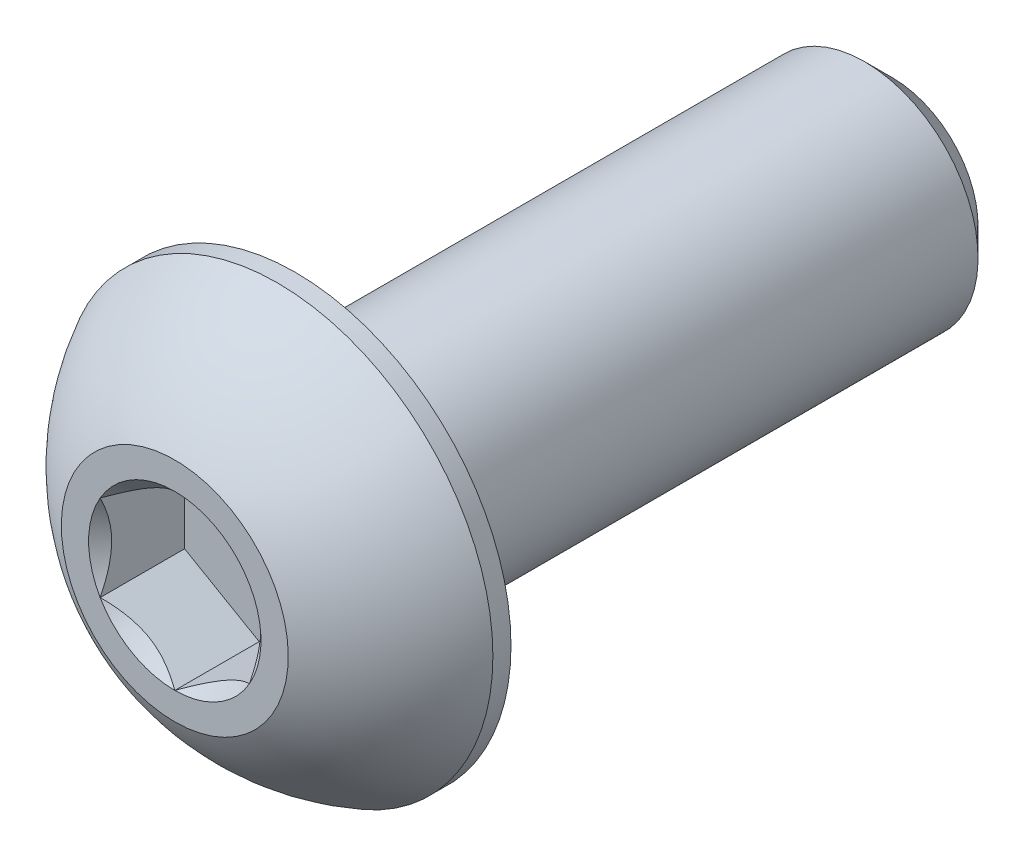
ISO-10303-21;
HEADER;
FILE_DESCRIPTION(('STEP AP214'),'2;1');
FILE_NAME('part.step','',(''),(''),'','','');
FILE_SCHEMA(('AUTOMOTIVE_DESIGN { 1 0 10303 214 1 1 1 1 }'));
ENDSEC;
DATA;
#1=APPLICATION_CONTEXT('core data for automotive mechanical design processes');
#2=APPLICATION_PROTOCOL_DEFINITION('international standard','automotive_design',2000,#1);
#3=PRODUCT_CONTEXT('',#1,'mechanical');
#4=PRODUCT('Part','Part','',(#3));
#5=PRODUCT_RELATED_PRODUCT_CATEGORY('part','',(#4));
#6=PRODUCT_DEFINITION_FORMATION('','',#4);
#7=PRODUCT_DEFINITION_CONTEXT('part definition',#1,'design');
#8=PRODUCT_DEFINITION('design','',#6,#7);
#9=PRODUCT_DEFINITION_SHAPE('','',#8);
#10=(LENGTH_UNIT() NAMED_UNIT(*) SI_UNIT(.MILLI.,.METRE.));
#11=(NAMED_UNIT(*) PLANE_ANGLE_UNIT() SI_UNIT($,.RADIAN.));
#12=(NAMED_UNIT(*) SI_UNIT($,.STERADIAN.) SOLID_ANGLE_UNIT());
#13=UNCERTAINTY_MEASURE_WITH_UNIT(LENGTH_MEASURE(1.E-05),#10,'distance_accuracy_value','');
#14=(GEOMETRIC_REPRESENTATION_CONTEXT(3) GLOBAL_UNCERTAINTY_ASSIGNED_CONTEXT((#13)) GLOBAL_UNIT_ASSIGNED_CONTEXT((#10,
#11,#12)) REPRESENTATION_CONTEXT('',''));
#15=CARTESIAN_POINT('',(0.,0.,0.));
#16=DIRECTION('',(0.,0.,1.));
#17=DIRECTION('',(1.,0.,0.));
#18=AXIS2_PLACEMENT_3D('',#15,#16,#17);
#19=CARTESIAN_POINT('',(0.,-2.41300000000001,-15.2654));
#20=DIRECTION('',(0.,0.,-1.));
#21=DIRECTION('',(0.,1.,0.));
#22=AXIS2_PLACEMENT_3D('',#19,#20,#21);
#23=PLANE('',#22);
#24=CARTESIAN_POINT('',(0.,0.,-15.2654));
#25=DIRECTION('',(0.,0.,-1.));
#26=DIRECTION('',(0.,1.,0.));
#27=AXIS2_PLACEMENT_3D('',#24,#25,#26);
#28=CIRCLE('',#27,1.81768750000001);
#29=CARTESIAN_POINT('',(0.,1.8176875,-15.2654));
#30=VERTEX_POINT('',#29);
#31=EDGE_CURVE('E42',#30,#30,#28,.T.);
#32=ORIENTED_EDGE('',*,*,#31,.T.);
#33=EDGE_LOOP('',(#32));
#34=FACE_BOUND('',#33,.T.);
#35=ADVANCED_FACE('F34',(#34),#23,.T.);
#36=CARTESIAN_POINT('',(0.,0.,-15.2654));
#37=DIRECTION('',(0.,0.,-1.));
#38=DIRECTION('',(0.,1.,0.));
#39=AXIS2_PLACEMENT_3D('',#36,#37,#38);
#40=CYLINDRICAL_SURFACE('',#39,2.413);
#41=CARTESIAN_POINT('',(0.,0.,-14.6700875));
#42=DIRECTION('',(0.,0.,-1.));
#43=DIRECTION('',(0.,1.,0.));
#44=AXIS2_PLACEMENT_3D('',#41,#42,#43);
#45=CIRCLE('',#44,2.413);
#46=CARTESIAN_POINT('',(0.,2.413,-14.6700875));
#47=VERTEX_POINT('',#46);
#48=EDGE_CURVE('E11',#47,#47,#45,.F.);
#49=ORIENTED_EDGE('',*,*,#48,.T.);
#50=EDGE_LOOP('',(#49));
#51=FACE_BOUND('',#50,.T.);
#52=CARTESIAN_POINT('',(0.,0.,-2.5654));
#53=DIRECTION('',(0.,0.,1.));
#54=DIRECTION('',(1.,0.,0.));
#55=AXIS2_PLACEMENT_3D('',#52,#53,#54);
#56=CIRCLE('',#55,2.413);
#57=CARTESIAN_POINT('',(2.413,0.,-2.5654));
#58=VERTEX_POINT('',#57);
#59=EDGE_CURVE('E168',#58,#58,#56,.F.);
#60=ORIENTED_EDGE('',*,*,#59,.T.);
#61=EDGE_LOOP('',(#60));
#62=FACE_BOUND('',#61,.T.);
#63=ADVANCED_FACE('F176',(#51,#62),#40,.T.);
#64=CARTESIAN_POINT('',(0.,0.,-15.2654));
#65=DIRECTION('',(0.,0.,1.));
#66=DIRECTION('',(0.,-1.,0.));
#67=AXIS2_PLACEMENT_3D('',#64,#65,#66);
#68=CONICAL_SURFACE('',#67,1.81768750000001,0.785398163397446);
#69=ORIENTED_EDGE('',*,*,#48,.F.);
#70=EDGE_LOOP('',(#69));
#71=FACE_BOUND('',#70,.T.);
#72=ORIENTED_EDGE('',*,*,#31,.F.);
#73=EDGE_LOOP('',(#72));
#74=FACE_BOUND('',#73,.T.);
#75=ADVANCED_FACE('F36',(#71,#74),#68,.T.);
#76=CARTESIAN_POINT('',(0.,0.,-4.5748806144438));
#77=DIRECTION('',(0.,0.,1.));
#78=DIRECTION('',(0.,-1.,0.));
#79=AXIS2_PLACEMENT_3D('',#76,#77,#78);
#80=SPHERICAL_SURFACE('',#79,5.17224338526463);
#81=CARTESIAN_POINT('',(0.,0.,0.));
#82=DIRECTION('',(0.,0.,1.));
#83=DIRECTION('',(1.,0.,0.));
#84=AXIS2_PLACEMENT_3D('',#81,#82,#83);
#85=CIRCLE('',#84,2.413);
#86=CARTESIAN_POINT('',(0.,-2.413,0.));
#87=VERTEX_POINT('',#86);
#88=EDGE_CURVE('E165',#87,#87,#85,.T.);
#89=CARTESIAN_POINT('',(0.,0.,-2.18059));
#90=DIRECTION('',(0.,0.,1.));
#91=DIRECTION('',(1.,0.,0.));
#92=AXIS2_PLACEMENT_3D('',#89,#90,#91);
#93=CIRCLE('',#92,4.5847);
#94=CARTESIAN_POINT('',(0.,-4.5847,-2.18059));
#95=VERTEX_POINT('',#94);
#96=EDGE_CURVE('E159',#95,#95,#93,.T.);
#97=CARTESIAN_POINT('',(0.,-2.413,0.));
#98=CARTESIAN_POINT('',(0.,-2.44179113663083,-0.0151857097788009));
#99=CARTESIAN_POINT('',(0.,-2.47043888331474,-0.0306432741933343));
#100=CARTESIAN_POINT('',(0.,-2.5274374690351,-0.0620964513369402));
#101=CARTESIAN_POINT('',(0.,-2.55578830807155,-0.0780920640660127));
#102=CARTESIAN_POINT('',(0.,-2.61218295074331,-0.110615676881771));
#103=CARTESIAN_POINT('',(0.,-2.64022675437863,-0.127143676968457));
#104=CARTESIAN_POINT('',(0.,-2.69599733629138,-0.160726162390165));
#105=CARTESIAN_POINT('',(0.,-2.72372411456882,-0.177780647725188));
#106=CARTESIAN_POINT('',(0.,-2.77885076121154,-0.21241002764294));
#107=CARTESIAN_POINT('',(0.,-2.80625062957682,-0.229984922225668));
#108=CARTESIAN_POINT('',(0.,-2.86071369040082,-0.265648855453746));
#109=CARTESIAN_POINT('',(0.,-2.88777688285954,-0.283737894099096));
#110=CARTESIAN_POINT('',(0.,-2.94155694533546,-0.320423667994127));
#111=CARTESIAN_POINT('',(0.,-2.96827381535265,-0.339020403243808));
#112=CARTESIAN_POINT('',(0.,-3.02135171000009,-0.37671494166065));
#113=CARTESIAN_POINT('',(0.,-3.04771273463033,-0.39581274482781));
#114=CARTESIAN_POINT('',(0.,-3.10006954235699,-0.434502611862808));
#115=CARTESIAN_POINT('',(0.,-3.12606532545341,-0.454094675730644));
#116=CARTESIAN_POINT('',(0.,-3.17768238416296,-0.493766080756604));
#117=CARTESIAN_POINT('',(0.,-3.20330365977609,-0.513845421914727));
#118=CARTESIAN_POINT('',(0.,-3.25416257105645,-0.554484224430573));
#119=CARTESIAN_POINT('',(0.,-3.27940020672367,-0.575043685788297));
#120=CARTESIAN_POINT('',(0.,-3.32948284239517,-0.616635400476975));
#121=CARTESIAN_POINT('',(0.,-3.35432784239946,-0.63766765380793));
#122=CARTESIAN_POINT('',(0.,-3.40361635097913,-0.680197455694829));
#123=CARTESIAN_POINT('',(0.,-3.42805985955453,-0.701695004250773));
#124=CARTESIAN_POINT('',(0.,-3.47653667261836,-0.745147733989217));
#125=CARTESIAN_POINT('',(0.,-3.5005699771068,-0.767102915171716));
#126=CARTESIAN_POINT('',(0.,-3.54821781555203,-0.81146308444603));
#127=CARTESIAN_POINT('',(0.,-3.57183234950881,-0.833868072537843));
#128=CARTESIAN_POINT('',(0.,-3.61863422971284,-0.879119869584105));
#129=CARTESIAN_POINT('',(0.,-3.64182157596008,-0.901966678538555));
#130=CARTESIAN_POINT('',(0.,-3.68776081583415,-0.948093973780533));
#131=CARTESIAN_POINT('',(0.,-3.71051270946098,-0.971374460068061));
#132=CARTESIAN_POINT('',(0.,-3.75557293439636,-1.01836081186645));
#133=CARTESIAN_POINT('',(0.,-3.7778812657049,-1.0420666773773));
#134=CARTESIAN_POINT('',(0.,-3.82204641440941,-1.08989533789018));
#135=CARTESIAN_POINT('',(0.,-3.84390323180538,-1.11401813289221));
#136=CARTESIAN_POINT('',(0.,-3.88715756202836,-1.16267205404467));
#137=CARTESIAN_POINT('',(0.,-3.90855507485536,-1.18720318019511));
#138=CARTESIAN_POINT('',(0.,-3.95088316899876,-1.23666501975588));
#139=CARTESIAN_POINT('',(0.,-3.97181375031515,-1.26159573316622));
#140=CARTESIAN_POINT('',(0.,-4.01320052092912,-1.31184786092909));
#141=CARTESIAN_POINT('',(0.,-4.03365671022669,-1.33716927528163));
#142=CARTESIAN_POINT('',(0.,-4.07408740538699,-1.38819377934977));
#143=CARTESIAN_POINT('',(0.,-4.09406191124973,-1.41389686906536));
#144=CARTESIAN_POINT('',(0.,-4.13352211981722,-1.46567556223513));
#145=CARTESIAN_POINT('',(0.,-4.15300782252198,-1.4917511656893));
#146=CARTESIAN_POINT('',(0.,-4.19148347927457,-1.54426559193551));
#147=CARTESIAN_POINT('',(0.,-4.2104734333224,-1.57070441472756));
#148=CARTESIAN_POINT('',(0.,-4.24795082398615,-1.6239358557723));
#149=CARTESIAN_POINT('',(0.,-4.26643826060207,-1.65072847402499));
#150=CARTESIAN_POINT('',(0.,-4.3029040266735,-1.70465795604563));
#151=CARTESIAN_POINT('',(0.,-4.32088235612901,-1.73179481981358));
#152=CARTESIAN_POINT('',(0.,-4.35632349988304,-1.78640312007115));
#153=CARTESIAN_POINT('',(0.,-4.37378631418156,-1.81387455656079));
#154=CARTESIAN_POINT('',(0.,-4.40819020238474,-1.86914221075438));
#155=CARTESIAN_POINT('',(0.,-4.42513127628939,-1.89693842845834));
#156=CARTESIAN_POINT('',(0.,-4.45848564813517,-1.95284573578717));
#157=CARTESIAN_POINT('',(0.,-4.4748989460763,-1.98095682541204));
#158=CARTESIAN_POINT('',(0.,-4.50719190474587,-2.03748386259807));
#159=CARTESIAN_POINT('',(0.,-4.5230715654743,-2.06589981015923));
#160=CARTESIAN_POINT('',(0.,-4.55429163018258,-2.12302641242262));
#161=CARTESIAN_POINT('',(0.,-4.56963203416241,-2.15173706712485));
#162=CARTESIAN_POINT('',(0.,-4.5847,-2.18059));
#163=B_SPLINE_CURVE_WITH_KNOTS('',3,(#97,#98,#99,#100,#101,#102,#103,#104,#105,#106,#107,#108,
#109,#110,#111,#112,#113,#114,#115,#116,#117,#118,#119,#120,#121,#122,#123,#124,#125,#126,#127,
#128,#129,#130,#131,#132,#133,#134,#135,#136,#137,#138,#139,#140,#141,#142,#143,#144,#145,#146,
#147,#148,#149,#150,#151,#152,#153,#154,#155,#156,#157,#158,#159,#160,#161,#162),.UNSPECIFIED.,
.F.,.F.,(4,2,2,2,2,2,2,2,2,2,2,2,2,2,2,2,2,2,2,2,2,2,2,2,2,2,2,2,2,2,2,2,4),(0.,
0.0976500604051489,0.195300120810298,0.292950181215447,0.390600241620598,0.488250302025747,
0.585900362430896,0.683550422836046,0.781200483241194,0.878850543646344,0.976500604051493,
1.07415066445664,1.17180072486179,1.26945078526694,1.36710084567209,1.46475090607724,
1.56240096648239,1.66005102688754,1.75770108729269,1.85535114769784,1.95300120810299,
2.05065126850814,2.14830132891329,2.24595138931843,2.34360144972358,2.44125151012873,
2.53890157053388,2.63655163093903,2.73420169134418,2.83185175174933,2.92950181215448,
3.02715187255963,3.12480193296478),.UNSPECIFIED.);
#164=EDGE_CURVE('BSEAM175',#87,#95,#163,.T.);
#165=ORIENTED_EDGE('',*,*,#88,.F.);
#166=ORIENTED_EDGE('',*,*,#96,.T.);
#167=ORIENTED_EDGE('',*,*,#164,.T.);
#168=ORIENTED_EDGE('',*,*,#164,.F.);
#169=EDGE_LOOP('',(#165,#167,#166,#168));
#170=FACE_BOUND('',#169,.T.);
#171=ADVANCED_FACE('F175',(#170),#80,.T.);
#172=CARTESIAN_POINT('',(0.,-2.413,0.));
#173=DIRECTION('',(0.,0.,-1.));
#174=DIRECTION('',(-1.,0.,0.));
#175=AXIS2_PLACEMENT_3D('',#172,#173,#174);
#176=PLANE('',#175);
#177=CARTESIAN_POINT('',(0.,0.,0.));
#178=DIRECTION('',(0.,0.,1.));
#179=DIRECTION('',(1.,0.,0.));
#180=AXIS2_PLACEMENT_3D('',#177,#178,#179);
#181=CIRCLE('',#180,1.83308710467706);
#182=CARTESIAN_POINT('',(-1.5875,0.91654355233853,0.));
#183=VERTEX_POINT('',#182);
#184=CARTESIAN_POINT('',(-1.5875,-0.916543552338531,0.));
#185=VERTEX_POINT('',#184);
#186=EDGE_CURVE('E55',#183,#185,#181,.T.);
#187=ORIENTED_EDGE('',*,*,#186,.F.);
#188=CARTESIAN_POINT('',(0.,1.83308710467706,0.));
#189=VERTEX_POINT('',#188);
#190=EDGE_CURVE('E129',#189,#183,#181,.T.);
#191=ORIENTED_EDGE('',*,*,#190,.F.);
#192=CARTESIAN_POINT('',(1.5875,0.916543552338531,0.));
#193=VERTEX_POINT('',#192);
#194=EDGE_CURVE('E106',#193,#189,#181,.T.);
#195=ORIENTED_EDGE('',*,*,#194,.F.);
#196=CARTESIAN_POINT('',(1.5875,-0.916543552338531,0.));
#197=VERTEX_POINT('',#196);
#198=EDGE_CURVE('E95',#197,#193,#181,.T.);
#199=ORIENTED_EDGE('',*,*,#198,.F.);
#200=CARTESIAN_POINT('',(0.,-1.83308710467706,0.));
#201=VERTEX_POINT('',#200);
#202=EDGE_CURVE('E87',#201,#197,#181,.T.);
#203=ORIENTED_EDGE('',*,*,#202,.F.);
#204=EDGE_CURVE('E48',#185,#201,#181,.T.);
#205=ORIENTED_EDGE('',*,*,#204,.F.);
#206=EDGE_LOOP('',(#187,#191,#195,#199,#203,#205));
#207=FACE_BOUND('',#206,.T.);
#208=ORIENTED_EDGE('',*,*,#88,.T.);
#209=EDGE_LOOP('',(#208));
#210=FACE_BOUND('',#209,.T.);
#211=ADVANCED_FACE('F126',(#207,#210),#176,.F.);
#212=CARTESIAN_POINT('',(0.,-4.5847,-2.5654));
#213=DIRECTION('',(0.,0.,1.));
#214=DIRECTION('',(1.,0.,0.));
#215=AXIS2_PLACEMENT_3D('',#212,#213,#214);
#216=PLANE('',#215);
#217=ORIENTED_EDGE('',*,*,#59,.F.);
#218=EDGE_LOOP('',(#217));
#219=FACE_BOUND('',#218,.T.);
#220=CARTESIAN_POINT('',(0.,0.,-2.5654));
#221=DIRECTION('',(0.,0.,1.));
#222=DIRECTION('',(1.,0.,0.));
#223=AXIS2_PLACEMENT_3D('',#220,#221,#222);
#224=CIRCLE('',#223,4.5847);
#225=CARTESIAN_POINT('',(4.5847,0.,-2.5654));
#226=VERTEX_POINT('',#225);
#227=EDGE_CURVE('E162',#226,#226,#224,.T.);
#228=ORIENTED_EDGE('',*,*,#227,.F.);
#229=EDGE_LOOP('',(#228));
#230=FACE_BOUND('',#229,.T.);
#231=ADVANCED_FACE('F193',(#219,#230),#216,.F.);
#232=CARTESIAN_POINT('',(0.,0.,0.));
#233=DIRECTION('',(0.,0.,1.));
#234=DIRECTION('',(1.,0.,0.));
#235=AXIS2_PLACEMENT_3D('',#232,#233,#234);
#236=CYLINDRICAL_SURFACE('',#235,4.5847);
#237=ORIENTED_EDGE('',*,*,#96,.F.);
#238=EDGE_LOOP('',(#237));
#239=FACE_BOUND('',#238,.T.);
#240=ORIENTED_EDGE('',*,*,#227,.T.);
#241=EDGE_LOOP('',(#240));
#242=FACE_BOUND('',#241,.T.);
#243=ADVANCED_FACE('F196',(#239,#242),#236,.T.);
#244=CARTESIAN_POINT('',(0.,0.,0.));
#245=DIRECTION('',(0.,0.,1.));
#246=DIRECTION('',(1.,0.,0.));
#247=AXIS2_PLACEMENT_3D('',#244,#245,#246);
#248=CONICAL_SURFACE('',#247,1.83308710467706,0.78539816339745);
#249=ORIENTED_EDGE('',*,*,#198,.T.);
#250=CARTESIAN_POINT('',(1.5875,-1.83163614232865,0.590762562254565));
#251=CARTESIAN_POINT('',(1.5875,-1.78705354844902,0.55707785480324));
#252=CARTESIAN_POINT('',(1.5875,-1.74222294150555,0.523722329968627));
#253=CARTESIAN_POINT('',(1.5875,-1.65196486784504,0.457805675888285));
#254=CARTESIAN_POINT('',(1.5875,-1.60653725449665,0.425244747634468));
#255=CARTESIAN_POINT('',(1.5875,-1.46854281940082,0.328493449461236));
#256=CARTESIAN_POINT('',(1.5875,-1.37494211623386,0.265753264612858));
#257=CARTESIAN_POINT('',(1.5875,-1.17864136265695,0.142553151294645));
#258=CARTESIAN_POINT('',(1.5875,-1.07572731596385,0.0824303289226488));
#259=CARTESIAN_POINT('',(1.5875,-0.864754189558117,-0.0275706334490079));
#260=CARTESIAN_POINT('',(1.5875,-0.756714033301438,-0.0774833149376714));
#261=CARTESIAN_POINT('',(1.5875,-0.594580029688666,-0.138547963751185));
#262=CARTESIAN_POINT('',(1.5875,-0.542894373932897,-0.156067797502568));
#263=CARTESIAN_POINT('',(1.5875,-0.43827206291756,-0.186958420156953));
#264=CARTESIAN_POINT('',(1.5875,-0.3853353220534,-0.200328924255393));
#265=CARTESIAN_POINT('',(1.5875,-0.27941340073437,-0.222002681044568));
#266=CARTESIAN_POINT('',(1.5875,-0.226446313904206,-0.230392976800141));
#267=CARTESIAN_POINT('',(1.5875,-0.119941637592404,-0.241941911012322));
#268=CARTESIAN_POINT('',(1.5875,-0.0664041486263234,-0.245101456366562));
#269=CARTESIAN_POINT('',(1.5875,0.0387581192420279,-0.245952982965122));
#270=CARTESIAN_POINT('',(1.5875,0.090381381554216,-0.243840334608509));
#271=CARTESIAN_POINT('',(1.5875,0.19318730201683,-0.234695846678065));
#272=CARTESIAN_POINT('',(1.5875,0.244369916988517,-0.227663530460197));
#273=CARTESIAN_POINT('',(1.5875,0.346790527788956,-0.208944949355169));
#274=CARTESIAN_POINT('',(1.5875,0.398013804172139,-0.197179358640977));
#275=CARTESIAN_POINT('',(1.5875,0.499340680307276,-0.169620657149212));
#276=CARTESIAN_POINT('',(1.5875,0.549444372105894,-0.153827878801824));
#277=CARTESIAN_POINT('',(1.5875,0.707022639586407,-0.0982133790717417));
#278=CARTESIAN_POINT('',(1.5875,0.812258737570578,-0.0520647672653368));
#279=CARTESIAN_POINT('',(1.5875,1.01778869013701,0.0505458403808823));
#280=CARTESIAN_POINT('',(1.5875,1.11806310933257,0.107044855107553));
#281=CARTESIAN_POINT('',(1.5875,1.30970442577157,0.223612502972616));
#282=CARTESIAN_POINT('',(1.5875,1.40126637149297,0.283364441978613));
#283=CARTESIAN_POINT('',(1.5875,1.53616443073864,0.37573700869171));
#284=CARTESIAN_POINT('',(1.5875,1.58054835823549,0.406854014274728));
#285=CARTESIAN_POINT('',(1.5875,1.66870952512132,0.469911550181166));
#286=CARTESIAN_POINT('',(1.5875,1.71248692801697,0.501851851647461));
#287=CARTESIAN_POINT('',(1.5875,1.75601179240957,0.534133557847131));
#288=B_SPLINE_CURVE_WITH_KNOTS('',3,(#250,#251,#252,#253,#254,#255,#256,#257,#258,#259,#260,
#261,#262,#263,#264,#265,#266,#267,#268,#269,#270,#271,#272,#273,#274,#275,#276,#277,#278,#279,
#280,#281,#282,#283,#284,#285,#286,#287),.UNSPECIFIED.,.F.,.F.,(4,2,2,2,2,2,2,2,2,2,2,2,2,2,2,2,
2,2,4),(0.,0.167627505127548,0.33529698084648,0.673194674702938,1.0304700708717,
1.38651603079307,1.55010049300858,1.71369618096554,1.87434127467533,2.034958513124,
2.18971280484453,2.34448209207484,2.50196108385089,2.65942708049529,3.00314617711216,
3.34811949873714,3.6759579216973,3.83856722085481,4.00113179576279),.UNSPECIFIED.);
#289=EDGE_CURVE('E100',#197,#193,#288,.T.);
#290=ORIENTED_EDGE('',*,*,#289,.F.);
#291=EDGE_LOOP('',(#249,#290));
#292=FACE_BOUND('',#291,.T.);
#293=ADVANCED_FACE('F101',(#292),#248,.F.);
#294=ORIENTED_EDGE('',*,*,#194,.T.);
#295=CARTESIAN_POINT('',(1.5877,0.916428082284693,0.000115480963706964));
#296=CARTESIAN_POINT('',(1.53312479190086,0.947937093371809,-0.0313691916294028));
#297=CARTESIAN_POINT('',(1.47763696320971,0.979973006203395,-0.0610049539864698));
#298=CARTESIAN_POINT('',(1.36449087915364,1.04529792829092,-0.115267739979175));
#299=CARTESIAN_POINT('',(1.30682185887062,1.07859315267522,-0.139864564866823));
#300=CARTESIAN_POINT('',(1.1905349781269,1.14573141457583,-0.181999635727418));
#301=CARTESIAN_POINT('',(1.13194674474407,1.17955734689075,-0.199643807270178));
#302=CARTESIAN_POINT('',(1.01348022674557,1.24795402294714,-0.226828529915031));
#303=CARTESIAN_POINT('',(0.953605562983896,1.28252267618758,-0.236389379304923));
#304=CARTESIAN_POINT('',(0.850418771876558,1.34209759781022,-0.245015586895992));
#305=CARTESIAN_POINT('',(0.807240015952288,1.36702686416637,-0.246292807190424));
#306=CARTESIAN_POINT('',(0.720953038535399,1.41684467380557,-0.244142944185295));
#307=CARTESIAN_POINT('',(0.677844847078612,1.44173319974742,-0.240714211450657));
#308=CARTESIAN_POINT('',(0.592046335002031,1.49126899379091,-0.229349005566657));
#309=CARTESIAN_POINT('',(0.549356408925407,1.51591603410293,-0.221408628198358));
#310=CARTESIAN_POINT('',(0.464693063478359,1.56479643938728,-0.201451585548899));
#311=CARTESIAN_POINT('',(0.422719959755075,1.58902962212064,-0.189433170791309));
#312=CARTESIAN_POINT('',(0.315211458113566,1.65109968448354,-0.153753102752754));
#313=CARTESIAN_POINT('',(0.2503427717089,1.68855163804125,-0.127401427696863));
#314=CARTESIAN_POINT('',(0.154961599380924,1.74361998356043,-0.082916463148298));
#315=CARTESIAN_POINT('',(0.123530699536157,1.76176662204668,-0.0672871421988686));
#316=CARTESIAN_POINT('',(0.0612469855696368,1.79772614107138,-0.0346015121388987));
#317=CARTESIAN_POINT('',(0.0303939039605763,1.8155391760437,-0.0175458843430302));
#318=CARTESIAN_POINT('',(-0.000200000000000412,1.8332025747309,0.000115480963706783));
#319=B_SPLINE_CURVE_WITH_KNOTS('',3,(#295,#296,#297,#298,#299,#300,#301,#302,#303,#304,#305,
#306,#307,#308,#309,#310,#311,#312,#313,#314,#315,#316,#317,#318),.UNSPECIFIED.,.F.,.F.,(4,2,2,
2,2,2,2,2,2,2,2,4),(0.,0.211482650810816,0.424197870807275,0.633533884524815,0.842342653263348,
0.99175555372714,1.14122083674204,1.29081565918877,1.44047473906437,1.6781878086972,
1.79671410024894,1.91518409436631),.UNSPECIFIED.);
#320=EDGE_CURVE('E105',#193,#189,#319,.T.);
#321=ORIENTED_EDGE('',*,*,#320,.F.);
#322=EDGE_LOOP('',(#294,#321));
#323=FACE_BOUND('',#322,.T.);
#324=ADVANCED_FACE('F287',(#323),#248,.F.);
#325=ORIENTED_EDGE('',*,*,#190,.T.);
#326=CARTESIAN_POINT('',(0.000199999999999602,1.8332025747309,0.000115480963706835));
#327=CARTESIAN_POINT('',(-0.0543752080991368,1.80169356364378,-0.031369191629403));
#328=CARTESIAN_POINT('',(-0.10986303679029,1.7696576508122,-0.06100495398647));
#329=CARTESIAN_POINT('',(-0.223009120846359,1.70433272872467,-0.115267739979175));
#330=CARTESIAN_POINT('',(-0.280678141129381,1.67103750434037,-0.139864564866824));
#331=CARTESIAN_POINT('',(-0.396965021873103,1.60389924243976,-0.181999635727418));
#332=CARTESIAN_POINT('',(-0.455553255255931,1.57007331012484,-0.199643807270178));
#333=CARTESIAN_POINT('',(-0.574019773254431,1.50167663406845,-0.226828529915031));
#334=CARTESIAN_POINT('',(-0.633894437016105,1.46710798082801,-0.236389379304923));
#335=CARTESIAN_POINT('',(-0.737081228123443,1.40753305920537,-0.245015586895992));
#336=CARTESIAN_POINT('',(-0.780259984047713,1.38260379284922,-0.246292807190424));
#337=CARTESIAN_POINT('',(-0.866546961464602,1.33278598321002,-0.244142944185295));
#338=CARTESIAN_POINT('',(-0.909655152921388,1.30789745726817,-0.240714211450657));
#339=CARTESIAN_POINT('',(-0.99545366499797,1.25836166322468,-0.229349005566657));
#340=CARTESIAN_POINT('',(-1.03814359107459,1.23371462291266,-0.221408628198358));
#341=CARTESIAN_POINT('',(-1.12280693652164,1.18483421762831,-0.201451585548899));
#342=CARTESIAN_POINT('',(-1.16478004024493,1.16060103489495,-0.189433170791309));
#343=CARTESIAN_POINT('',(-1.27228854188643,1.09853097253205,-0.153753102752754));
#344=CARTESIAN_POINT('',(-1.3371572282911,1.06107901897434,-0.127401427696863));
#345=CARTESIAN_POINT('',(-1.43253840061908,1.00601067345516,-0.082916463148298));
#346=CARTESIAN_POINT('',(-1.46396930046384,0.987864034968913,-0.0672871421988685));
#347=CARTESIAN_POINT('',(-1.52625301443036,0.951904515944214,-0.0346015121388985));
#348=CARTESIAN_POINT('',(-1.55710609603942,0.934091480971893,-0.0175458843430301));
#349=CARTESIAN_POINT('',(-1.5877,0.916428082284692,0.000115480963706555));
#350=B_SPLINE_CURVE_WITH_KNOTS('',3,(#326,#327,#328,#329,#330,#331,#332,#333,#334,#335,#336,
#337,#338,#339,#340,#341,#342,#343,#344,#345,#346,#347,#348,#349),.UNSPECIFIED.,.F.,.F.,(4,2,2,
2,2,2,2,2,2,2,2,4),(0.,0.211482650810816,0.424197870807276,0.633533884524816,0.842342653263348,
0.991755553727141,1.14122083674205,1.29081565918877,1.44047473906438,1.6781878086972,
1.79671410024894,1.91518409436631),.UNSPECIFIED.);
#351=EDGE_CURVE('E136',#189,#183,#350,.T.);
#352=ORIENTED_EDGE('',*,*,#351,.F.);
#353=EDGE_LOOP('',(#325,#352));
#354=FACE_BOUND('',#353,.T.);
#355=ADVANCED_FACE('F134',(#354),#248,.F.);
#356=ORIENTED_EDGE('',*,*,#186,.T.);
#357=CARTESIAN_POINT('',(-1.5875,-1.83163614232865,0.590762562254564));
#358=CARTESIAN_POINT('',(-1.5875,-1.78705354844902,0.557077854803239));
#359=CARTESIAN_POINT('',(-1.5875,-1.74222294150555,0.523722329968626));
#360=CARTESIAN_POINT('',(-1.5875,-1.65196486784504,0.457805675888285));
#361=CARTESIAN_POINT('',(-1.5875,-1.60653725449665,0.425244747634468));
#362=CARTESIAN_POINT('',(-1.5875,-1.46854281940082,0.328493449461235));
#363=CARTESIAN_POINT('',(-1.5875,-1.37494211623386,0.265753264612857));
#364=CARTESIAN_POINT('',(-1.5875,-1.17864136265695,0.142553151294644));
#365=CARTESIAN_POINT('',(-1.5875,-1.07572731596385,0.0824303289226486));
#366=CARTESIAN_POINT('',(-1.5875,-0.864754189558117,-0.0275706334490081));
#367=CARTESIAN_POINT('',(-1.5875,-0.756714033301438,-0.0774833149376718));
#368=CARTESIAN_POINT('',(-1.5875,-0.594580029688666,-0.138547963751185));
#369=CARTESIAN_POINT('',(-1.5875,-0.542894373932898,-0.156067797502568));
#370=CARTESIAN_POINT('',(-1.5875,-0.438272062917561,-0.186958420156953));
#371=CARTESIAN_POINT('',(-1.5875,-0.385335322053401,-0.200328924255393));
#372=CARTESIAN_POINT('',(-1.5875,-0.27941340073437,-0.222002681044568));
#373=CARTESIAN_POINT('',(-1.5875,-0.226446313904207,-0.230392976800141));
#374=CARTESIAN_POINT('',(-1.5875,-0.119941637592405,-0.241941911012322));
#375=CARTESIAN_POINT('',(-1.5875,-0.0664041486263238,-0.245101456366562));
#376=CARTESIAN_POINT('',(-1.5875,0.0387581192420274,-0.245952982965122));
#377=CARTESIAN_POINT('',(-1.5875,0.0903813815542156,-0.243840334608509));
#378=CARTESIAN_POINT('',(-1.5875,0.193187302016829,-0.234695846678065));
#379=CARTESIAN_POINT('',(-1.5875,0.244369916988516,-0.227663530460197));
#380=CARTESIAN_POINT('',(-1.5875,0.346790527788956,-0.208944949355169));
#381=CARTESIAN_POINT('',(-1.5875,0.398013804172139,-0.197179358640977));
#382=CARTESIAN_POINT('',(-1.5875,0.499340680307276,-0.169620657149213));
#383=CARTESIAN_POINT('',(-1.5875,0.549444372105893,-0.153827878801824));
#384=CARTESIAN_POINT('',(-1.5875,0.707022639586407,-0.0982133790717423));
#385=CARTESIAN_POINT('',(-1.5875,0.812258737570577,-0.0520647672653372));
#386=CARTESIAN_POINT('',(-1.5875,1.01778869013701,0.050545840380882));
#387=CARTESIAN_POINT('',(-1.5875,1.11806310933256,0.107044855107552));
#388=CARTESIAN_POINT('',(-1.5875,1.30970442577157,0.223612502972616));
#389=CARTESIAN_POINT('',(-1.5875,1.40126637149297,0.283364441978612));
#390=CARTESIAN_POINT('',(-1.5875,1.53616443073864,0.375737008691709));
#391=CARTESIAN_POINT('',(-1.5875,1.58054835823549,0.406854014274727));
#392=CARTESIAN_POINT('',(-1.5875,1.66870952512132,0.469911550181165));
#393=CARTESIAN_POINT('',(-1.5875,1.71248692801697,0.50185185164746));
#394=CARTESIAN_POINT('',(-1.5875,1.75601179240957,0.53413355784713));
#395=B_SPLINE_CURVE_WITH_KNOTS('',3,(#357,#358,#359,#360,#361,#362,#363,#364,#365,#366,#367,
#368,#369,#370,#371,#372,#373,#374,#375,#376,#377,#378,#379,#380,#381,#382,#383,#384,#385,#386,
#387,#388,#389,#390,#391,#392,#393,#394),.UNSPECIFIED.,.F.,.F.,(4,2,2,2,2,2,2,2,2,2,2,2,2,2,2,2,
2,2,4),(0.,0.167627505127548,0.335296980846479,0.673194674702938,1.0304700708717,
1.38651603079307,1.55010049300858,1.71369618096554,1.87434127467533,2.034958513124,
2.18971280484453,2.34448209207484,2.50196108385089,2.65942708049529,3.00314617711216,
3.34811949873714,3.67595792169729,3.83856722085481,4.00113179576279),.UNSPECIFIED.);
#396=EDGE_CURVE('E140',#183,#185,#395,.F.);
#397=ORIENTED_EDGE('',*,*,#396,.F.);
#398=EDGE_LOOP('',(#356,#397));
#399=FACE_BOUND('',#398,.T.);
#400=ADVANCED_FACE('F281',(#399),#248,.F.);
#401=ORIENTED_EDGE('',*,*,#204,.T.);
#402=CARTESIAN_POINT('',(-1.5877,-0.916428082284693,0.000115480963706531));
#403=CARTESIAN_POINT('',(-1.53312479190086,-0.947937093371809,-0.0313691916294031));
#404=CARTESIAN_POINT('',(-1.47763696320971,-0.979973006203394,-0.06100495398647));
#405=CARTESIAN_POINT('',(-1.36449087915364,-1.04529792829092,-0.115267739979175));
#406=CARTESIAN_POINT('',(-1.30682185887062,-1.07859315267522,-0.139864564866824));
#407=CARTESIAN_POINT('',(-1.1905349781269,-1.14573141457583,-0.181999635727418));
#408=CARTESIAN_POINT('',(-1.13194674474407,-1.17955734689075,-0.199643807270178));
#409=CARTESIAN_POINT('',(-1.01348022674557,-1.24795402294714,-0.226828529915031));
#410=CARTESIAN_POINT('',(-0.953605562983895,-1.28252267618758,-0.236389379304923));
#411=CARTESIAN_POINT('',(-0.850418771876558,-1.34209759781022,-0.245015586895992));
#412=CARTESIAN_POINT('',(-0.807240015952288,-1.36702686416637,-0.246292807190424));
#413=CARTESIAN_POINT('',(-0.720953038535399,-1.41684467380557,-0.244142944185295));
#414=CARTESIAN_POINT('',(-0.677844847078612,-1.44173319974742,-0.240714211450657));
#415=CARTESIAN_POINT('',(-0.592046335002031,-1.49126899379091,-0.229349005566657));
#416=CARTESIAN_POINT('',(-0.549356408925407,-1.51591603410293,-0.221408628198358));
#417=CARTESIAN_POINT('',(-0.464693063478359,-1.56479643938728,-0.201451585548899));
#418=CARTESIAN_POINT('',(-0.422719959755075,-1.58902962212064,-0.189433170791309));
#419=CARTESIAN_POINT('',(-0.315211458113566,-1.65109968448354,-0.153753102752754));
#420=CARTESIAN_POINT('',(-0.2503427717089,-1.68855163804125,-0.127401427696864));
#421=CARTESIAN_POINT('',(-0.154961599380924,-1.74361998356043,-0.082916463148298));
#422=CARTESIAN_POINT('',(-0.123530699536156,-1.76176662204668,-0.0672871421988684));
#423=CARTESIAN_POINT('',(-0.0612469855696366,-1.79772614107138,-0.0346015121388983));
#424=CARTESIAN_POINT('',(-0.030393903960576,-1.8155391760437,-0.0175458843430298));
#425=CARTESIAN_POINT('',(0.000200000000000753,-1.8332025747309,0.000115480963706965));
#426=B_SPLINE_CURVE_WITH_KNOTS('',3,(#402,#403,#404,#405,#406,#407,#408,#409,#410,#411,#412,
#413,#414,#415,#416,#417,#418,#419,#420,#421,#422,#423,#424,#425),.UNSPECIFIED.,.F.,.F.,(4,2,2,
2,2,2,2,2,2,2,2,4),(0.,0.211482650810816,0.424197870807275,0.633533884524815,0.842342653263347,
0.99175555372714,1.14122083674204,1.29081565918877,1.44047473906437,1.6781878086972,
1.79671410024894,1.91518409436631),.UNSPECIFIED.);
#427=EDGE_CURVE('E116',#185,#201,#426,.T.);
#428=ORIENTED_EDGE('',*,*,#427,.F.);
#429=EDGE_LOOP('',(#401,#428));
#430=FACE_BOUND('',#429,.T.);
#431=ADVANCED_FACE('F225',(#430),#248,.F.);
#432=ORIENTED_EDGE('',*,*,#202,.T.);
#433=CARTESIAN_POINT('',(-0.000199999999999123,-1.8332025747309,0.000115480963707269));
#434=CARTESIAN_POINT('',(0.0543752080991372,-1.80169356364378,-0.0313691916294027));
#435=CARTESIAN_POINT('',(0.109863036790291,-1.7696576508122,-0.0610049539864697));
#436=CARTESIAN_POINT('',(0.22300912084636,-1.70433272872467,-0.115267739979174));
#437=CARTESIAN_POINT('',(0.280678141129382,-1.67103750434037,-0.139864564866823));
#438=CARTESIAN_POINT('',(0.396965021873104,-1.60389924243976,-0.181999635727418));
#439=CARTESIAN_POINT('',(0.455553255255932,-1.57007331012484,-0.199643807270178));
#440=CARTESIAN_POINT('',(0.574019773254432,-1.50167663406845,-0.226828529915031));
#441=CARTESIAN_POINT('',(0.633894437016106,-1.46710798082801,-0.236389379304922));
#442=CARTESIAN_POINT('',(0.737081228123443,-1.40753305920537,-0.245015586895992));
#443=CARTESIAN_POINT('',(0.780259984047713,-1.38260379284922,-0.246292807190423));
#444=CARTESIAN_POINT('',(0.866546961464602,-1.33278598321002,-0.244142944185295));
#445=CARTESIAN_POINT('',(0.909655152921389,-1.30789745726817,-0.240714211450656));
#446=CARTESIAN_POINT('',(0.99545366499797,-1.25836166322468,-0.229349005566656));
#447=CARTESIAN_POINT('',(1.03814359107459,-1.23371462291266,-0.221408628198358));
#448=CARTESIAN_POINT('',(1.12280693652164,-1.18483421762831,-0.201451585548898));
#449=CARTESIAN_POINT('',(1.16478004024493,-1.16060103489495,-0.189433170791309));
#450=CARTESIAN_POINT('',(1.27228854188643,-1.09853097253205,-0.153753102752754));
#451=CARTESIAN_POINT('',(1.3371572282911,-1.06107901897434,-0.127401427696863));
#452=CARTESIAN_POINT('',(1.43253840061908,-1.00601067345516,-0.0829164631482976));
#453=CARTESIAN_POINT('',(1.46396930046384,-0.987864034968914,-0.0672871421988682));
#454=CARTESIAN_POINT('',(1.52625301443036,-0.951904515944214,-0.0346015121388983));
#455=CARTESIAN_POINT('',(1.55710609603942,-0.934091480971893,-0.0175458843430299));
#456=CARTESIAN_POINT('',(1.5877,-0.916428082284693,0.000115480963706771));
#457=B_SPLINE_CURVE_WITH_KNOTS('',3,(#433,#434,#435,#436,#437,#438,#439,#440,#441,#442,#443,
#444,#445,#446,#447,#448,#449,#450,#451,#452,#453,#454,#455,#456),.UNSPECIFIED.,.F.,.F.,(4,2,2,
2,2,2,2,2,2,2,2,4),(0.,0.211482650810816,0.424197870807276,0.633533884524815,0.842342653263348,
0.991755553727141,1.14122083674205,1.29081565918877,1.44047473906438,1.6781878086972,
1.79671410024894,1.91518409436631),.UNSPECIFIED.);
#458=EDGE_CURVE('E91',#201,#197,#457,.T.);
#459=ORIENTED_EDGE('',*,*,#458,.F.);
#460=EDGE_LOOP('',(#432,#459));
#461=FACE_BOUND('',#460,.T.);
#462=ADVANCED_FACE('F89',(#461),#248,.F.);
#463=CARTESIAN_POINT('',(1.5875,-0.916543552338531,-1.79578));
#464=DIRECTION('',(0.,0.,1.));
#465=DIRECTION('',(1.,0.,0.));
#466=AXIS2_PLACEMENT_3D('',#463,#464,#465);
#467=PLANE('',#466);
#468=DIRECTION('',(0.866025403784438,0.5,0.));
#469=VECTOR('',#468,1.);
#470=CARTESIAN_POINT('',(0.,-1.83308710467706,-1.79578));
#471=LINE('',#470,#469);
#472=CARTESIAN_POINT('',(0.,-1.83308710467706,-1.79578));
#473=VERTEX_POINT('',#472);
#474=CARTESIAN_POINT('',(1.5875,-0.916543552338531,-1.79578));
#475=VERTEX_POINT('',#474);
#476=EDGE_CURVE('E115',#473,#475,#471,.T.);
#477=ORIENTED_EDGE('',*,*,#476,.T.);
#478=DIRECTION('',(0.,1.,0.));
#479=VECTOR('',#478,1.);
#480=CARTESIAN_POINT('',(1.5875,-0.916543552338531,-1.79578));
#481=LINE('',#480,#479);
#482=CARTESIAN_POINT('',(1.5875,0.916543552338531,-1.79578));
#483=VERTEX_POINT('',#482);
#484=EDGE_CURVE('E120',#475,#483,#481,.T.);
#485=ORIENTED_EDGE('',*,*,#484,.T.);
#486=DIRECTION('',(-0.866025403784439,0.5,0.));
#487=VECTOR('',#486,1.);
#488=CARTESIAN_POINT('',(1.5875,0.916543552338531,-1.79578));
#489=LINE('',#488,#487);
#490=CARTESIAN_POINT('',(0.,1.83308710467706,-1.79578));
#491=VERTEX_POINT('',#490);
#492=EDGE_CURVE('E271',#483,#491,#489,.T.);
#493=ORIENTED_EDGE('',*,*,#492,.T.);
#494=DIRECTION('',(-0.866025403784438,-0.5,0.));
#495=VECTOR('',#494,1.);
#496=CARTESIAN_POINT('',(0.,1.83308710467706,-1.79578));
#497=LINE('',#496,#495);
#498=CARTESIAN_POINT('',(-1.5875,0.91654355233853,-1.79578));
#499=VERTEX_POINT('',#498);
#500=EDGE_CURVE('E150',#491,#499,#497,.T.);
#501=ORIENTED_EDGE('',*,*,#500,.T.);
#502=DIRECTION('',(0.,-1.,0.));
#503=VECTOR('',#502,1.);
#504=CARTESIAN_POINT('',(-1.5875,0.91654355233853,-1.79578));
#505=LINE('',#504,#503);
#506=CARTESIAN_POINT('',(-1.5875,-0.916543552338531,-1.79578));
#507=VERTEX_POINT('',#506);
#508=EDGE_CURVE('E275',#499,#507,#505,.T.);
#509=ORIENTED_EDGE('',*,*,#508,.T.);
#510=DIRECTION('',(0.866025403784439,-0.5,0.));
#511=VECTOR('',#510,1.);
#512=CARTESIAN_POINT('',(-1.5875,-0.916543552338531,-1.79578));
#513=LINE('',#512,#511);
#514=EDGE_CURVE('E123',#507,#473,#513,.T.);
#515=ORIENTED_EDGE('',*,*,#514,.T.);
#516=EDGE_LOOP('',(#477,#485,#493,#501,#509,#515));
#517=FACE_BOUND('',#516,.T.);
#518=ADVANCED_FACE('F224',(#517),#467,.T.);
#519=CARTESIAN_POINT('',(1.5875,-0.916543552338531,-1.79578));
#520=DIRECTION('',(1.,0.,0.));
#521=DIRECTION('',(0.,0.,-1.));
#522=AXIS2_PLACEMENT_3D('',#519,#520,#521);
#523=PLANE('',#522);
#524=DIRECTION('',(0.,0.,1.));
#525=VECTOR('',#524,1.);
#526=CARTESIAN_POINT('',(1.5875,-0.916543552338531,-1.79578));
#527=LINE('',#526,#525);
#528=EDGE_CURVE('E112',#475,#197,#527,.T.);
#529=ORIENTED_EDGE('',*,*,#528,.T.);
#530=ORIENTED_EDGE('',*,*,#289,.T.);
#531=DIRECTION('',(0.,0.,1.));
#532=VECTOR('',#531,1.);
#533=CARTESIAN_POINT('',(1.5875,0.916543552338531,-1.79578));
#534=LINE('',#533,#532);
#535=EDGE_CURVE('E122',#483,#193,#534,.T.);
#536=ORIENTED_EDGE('',*,*,#535,.F.);
#537=ORIENTED_EDGE('',*,*,#484,.F.);
#538=EDGE_LOOP('',(#529,#530,#536,#537));
#539=FACE_BOUND('',#538,.T.);
#540=ADVANCED_FACE('F118',(#539),#523,.F.);
#541=CARTESIAN_POINT('',(1.5875,0.916543552338531,-1.79578));
#542=DIRECTION('',(0.5,0.866025403784439,0.));
#543=DIRECTION('',(-0.866025403784439,0.5,0.));
#544=AXIS2_PLACEMENT_3D('',#541,#542,#543);
#545=PLANE('',#544);
#546=ORIENTED_EDGE('',*,*,#535,.T.);
#547=ORIENTED_EDGE('',*,*,#320,.T.);
#548=DIRECTION('',(0.,0.,1.));
#549=VECTOR('',#548,1.);
#550=CARTESIAN_POINT('',(0.,1.83308710467706,-1.79578));
#551=LINE('',#550,#549);
#552=EDGE_CURVE('E145',#491,#189,#551,.T.);
#553=ORIENTED_EDGE('',*,*,#552,.F.);
#554=ORIENTED_EDGE('',*,*,#492,.F.);
#555=EDGE_LOOP('',(#546,#547,#553,#554));
#556=FACE_BOUND('',#555,.T.);
#557=ADVANCED_FACE('F143',(#556),#545,.F.);
#558=CARTESIAN_POINT('',(0.,1.83308710467706,-1.79578));
#559=DIRECTION('',(-0.5,0.866025403784438,0.));
#560=DIRECTION('',(-0.866025403784439,-0.5,0.));
#561=AXIS2_PLACEMENT_3D('',#558,#559,#560);
#562=PLANE('',#561);
#563=ORIENTED_EDGE('',*,*,#552,.T.);
#564=ORIENTED_EDGE('',*,*,#351,.T.);
#565=DIRECTION('',(0.,0.,1.));
#566=VECTOR('',#565,1.);
#567=CARTESIAN_POINT('',(-1.5875,0.91654355233853,-1.79578));
#568=LINE('',#567,#566);
#569=EDGE_CURVE('E152',#499,#183,#568,.T.);
#570=ORIENTED_EDGE('',*,*,#569,.F.);
#571=ORIENTED_EDGE('',*,*,#500,.F.);
#572=EDGE_LOOP('',(#563,#564,#570,#571));
#573=FACE_BOUND('',#572,.T.);
#574=ADVANCED_FACE('F148',(#573),#562,.F.);
#575=CARTESIAN_POINT('',(-1.5875,0.91654355233853,-1.79578));
#576=DIRECTION('',(-1.,0.,0.));
#577=DIRECTION('',(0.,-1.,0.));
#578=AXIS2_PLACEMENT_3D('',#575,#576,#577);
#579=PLANE('',#578);
#580=ORIENTED_EDGE('',*,*,#569,.T.);
#581=ORIENTED_EDGE('',*,*,#396,.T.);
#582=DIRECTION('',(0.,0.,1.));
#583=VECTOR('',#582,1.);
#584=CARTESIAN_POINT('',(-1.5875,-0.916543552338531,-1.79578));
#585=LINE('',#584,#583);
#586=EDGE_CURVE('E154',#507,#185,#585,.T.);
#587=ORIENTED_EDGE('',*,*,#586,.F.);
#588=ORIENTED_EDGE('',*,*,#508,.F.);
#589=EDGE_LOOP('',(#580,#581,#587,#588));
#590=FACE_BOUND('',#589,.T.);
#591=ADVANCED_FACE('F250',(#590),#579,.F.);
#592=CARTESIAN_POINT('',(-1.5875,-0.916543552338531,-1.79578));
#593=DIRECTION('',(-0.5,-0.866025403784439,0.));
#594=DIRECTION('',(0.866025403784439,-0.5,0.));
#595=AXIS2_PLACEMENT_3D('',#592,#593,#594);
#596=PLANE('',#595);
#597=ORIENTED_EDGE('',*,*,#586,.T.);
#598=ORIENTED_EDGE('',*,*,#427,.T.);
#599=DIRECTION('',(0.,0.,1.));
#600=VECTOR('',#599,1.);
#601=CARTESIAN_POINT('',(0.,-1.83308710467706,-1.79578));
#602=LINE('',#601,#600);
#603=EDGE_CURVE('E114',#473,#201,#602,.T.);
#604=ORIENTED_EDGE('',*,*,#603,.F.);
#605=ORIENTED_EDGE('',*,*,#514,.F.);
#606=EDGE_LOOP('',(#597,#598,#604,#605));
#607=FACE_BOUND('',#606,.T.);
#608=ADVANCED_FACE('F204',(#607),#596,.F.);
#609=CARTESIAN_POINT('',(0.,-1.83308710467706,-1.79578));
#610=DIRECTION('',(0.5,-0.866025403784438,0.));
#611=DIRECTION('',(0.866025403784438,0.5,0.));
#612=AXIS2_PLACEMENT_3D('',#609,#610,#611);
#613=PLANE('',#612);
#614=ORIENTED_EDGE('',*,*,#603,.T.);
#615=ORIENTED_EDGE('',*,*,#458,.T.);
#616=ORIENTED_EDGE('',*,*,#528,.F.);
#617=ORIENTED_EDGE('',*,*,#476,.F.);
#618=EDGE_LOOP('',(#614,#615,#616,#617));
#619=FACE_BOUND('',#618,.T.);
#620=ADVANCED_FACE('F110',(#619),#613,.F.);
#621=CLOSED_SHELL('',(#35,#63,#75,#171,#211,#231,#243,#293,#324,#355,#400,#431,#462,#518,#540,
#557,#574,#591,#608,#620));
#622=MANIFOLD_SOLID_BREP('B2',#621);
#623=ADVANCED_BREP_SHAPE_REPRESENTATION('',(#18,#622),#14);
#624=SHAPE_DEFINITION_REPRESENTATION(#9,#623);
ENDSEC;
END-ISO-10303-21;
